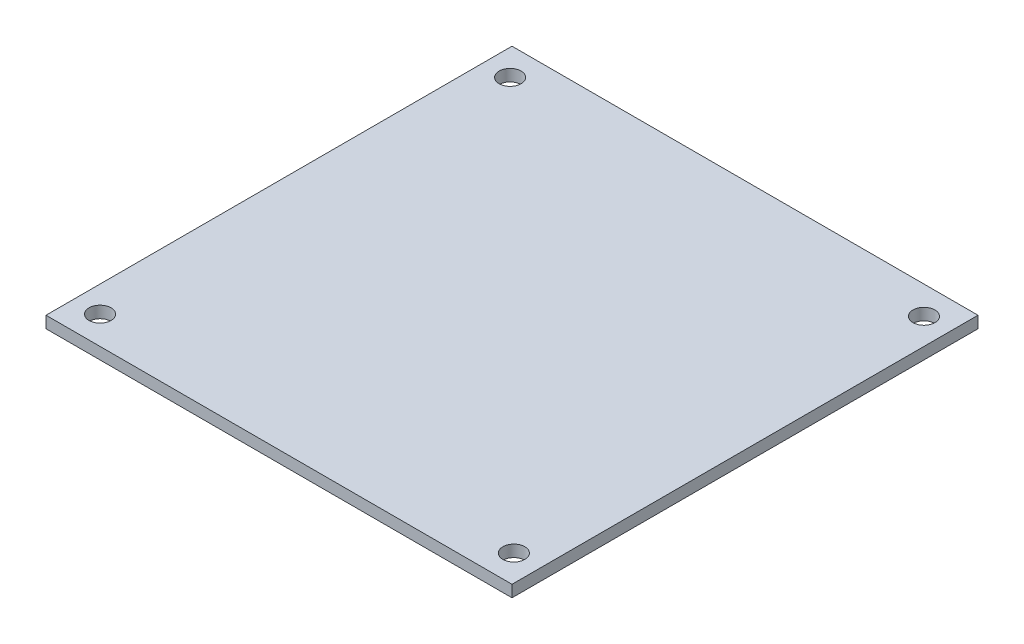
ISO-10303-21;
HEADER;
FILE_DESCRIPTION(('STEP AP214'),'2;1');
FILE_NAME('part.step','',(''),(''),'','','');
FILE_SCHEMA(('AUTOMOTIVE_DESIGN { 1 0 10303 214 1 1 1 1 }'));
ENDSEC;
DATA;
#1=APPLICATION_CONTEXT('core data for automotive mechanical design processes');
#2=APPLICATION_PROTOCOL_DEFINITION('international standard','automotive_design',2000,#1);
#3=PRODUCT_CONTEXT('',#1,'mechanical');
#4=PRODUCT('Part','Part','',(#3));
#5=PRODUCT_RELATED_PRODUCT_CATEGORY('part','',(#4));
#6=PRODUCT_DEFINITION_FORMATION('','',#4);
#7=PRODUCT_DEFINITION_CONTEXT('part definition',#1,'design');
#8=PRODUCT_DEFINITION('design','',#6,#7);
#9=PRODUCT_DEFINITION_SHAPE('','',#8);
#10=(LENGTH_UNIT() NAMED_UNIT(*) SI_UNIT(.MILLI.,.METRE.));
#11=(NAMED_UNIT(*) PLANE_ANGLE_UNIT() SI_UNIT($,.RADIAN.));
#12=(NAMED_UNIT(*) SI_UNIT($,.STERADIAN.) SOLID_ANGLE_UNIT());
#13=UNCERTAINTY_MEASURE_WITH_UNIT(LENGTH_MEASURE(1.E-05),#10,'distance_accuracy_value','');
#14=(GEOMETRIC_REPRESENTATION_CONTEXT(3) GLOBAL_UNCERTAINTY_ASSIGNED_CONTEXT((#13)) GLOBAL_UNIT_ASSIGNED_CONTEXT((#10,
#11,#12)) REPRESENTATION_CONTEXT('',''));
#15=CARTESIAN_POINT('',(0.,0.,0.));
#16=DIRECTION('',(0.,0.,1.));
#17=DIRECTION('',(1.,0.,0.));
#18=AXIS2_PLACEMENT_3D('',#15,#16,#17);
#19=CARTESIAN_POINT('',(0.,1.6,0.));
#20=DIRECTION('',(0.,1.,0.));
#21=DIRECTION('',(0.,0.,1.));
#22=AXIS2_PLACEMENT_3D('',#19,#20,#21);
#23=PLANE('',#22);
#24=CARTESIAN_POINT('',(28.194,1.6,27.94));
#25=DIRECTION('',(0.,1.,0.));
#26=DIRECTION('',(0.,0.,-1.));
#27=AXIS2_PLACEMENT_3D('',#24,#25,#26);
#28=CIRCLE('',#27,1.5);
#29=CARTESIAN_POINT('',(28.194,1.6,26.44));
#30=VERTEX_POINT('',#29);
#31=EDGE_CURVE('E122',#30,#30,#28,.T.);
#32=ORIENTED_EDGE('',*,*,#31,.F.);
#33=EDGE_LOOP('',(#32));
#34=FACE_BOUND('',#33,.T.);
#35=CARTESIAN_POINT('',(-28.194,1.6,-27.94));
#36=DIRECTION('',(0.,1.,0.));
#37=DIRECTION('',(0.,0.,1.));
#38=AXIS2_PLACEMENT_3D('',#35,#36,#37);
#39=CIRCLE('',#38,1.5);
#40=CARTESIAN_POINT('',(-28.194,1.6,-26.44));
#41=VERTEX_POINT('',#40);
#42=EDGE_CURVE('E101',#41,#41,#39,.T.);
#43=ORIENTED_EDGE('',*,*,#42,.F.);
#44=EDGE_LOOP('',(#43));
#45=FACE_BOUND('',#44,.T.);
#46=DIRECTION('',(0.,0.,1.));
#47=VECTOR('',#46,1.);
#48=CARTESIAN_POINT('',(-31.75,1.6,31.75));
#49=LINE('',#48,#47);
#50=CARTESIAN_POINT('',(-31.75,1.6,-31.75));
#51=VERTEX_POINT('',#50);
#52=CARTESIAN_POINT('',(-31.75,1.6,31.75));
#53=VERTEX_POINT('',#52);
#54=EDGE_CURVE('E86',#51,#53,#49,.T.);
#55=ORIENTED_EDGE('',*,*,#54,.T.);
#56=DIRECTION('',(1.,0.,0.));
#57=VECTOR('',#56,1.);
#58=CARTESIAN_POINT('',(31.75,1.6,31.75));
#59=LINE('',#58,#57);
#60=CARTESIAN_POINT('',(31.75,1.6,31.75));
#61=VERTEX_POINT('',#60);
#62=EDGE_CURVE('E81',#53,#61,#59,.T.);
#63=ORIENTED_EDGE('',*,*,#62,.T.);
#64=DIRECTION('',(0.,0.,-1.));
#65=VECTOR('',#64,1.);
#66=CARTESIAN_POINT('',(31.75,1.6,31.75));
#67=LINE('',#66,#65);
#68=CARTESIAN_POINT('',(31.75,1.6,-31.75));
#69=VERTEX_POINT('',#68);
#70=EDGE_CURVE('E84',#61,#69,#67,.T.);
#71=ORIENTED_EDGE('',*,*,#70,.T.);
#72=DIRECTION('',(-1.,0.,0.));
#73=VECTOR('',#72,1.);
#74=CARTESIAN_POINT('',(31.75,1.6,-31.75));
#75=LINE('',#74,#73);
#76=EDGE_CURVE('E51',#69,#51,#75,.T.);
#77=ORIENTED_EDGE('',*,*,#76,.T.);
#78=EDGE_LOOP('',(#55,#63,#71,#77));
#79=FACE_BOUND('',#78,.T.);
#80=CARTESIAN_POINT('',(28.194,1.6,-27.94));
#81=DIRECTION('',(0.,1.,0.));
#82=DIRECTION('',(0.,0.,1.));
#83=AXIS2_PLACEMENT_3D('',#80,#81,#82);
#84=CIRCLE('',#83,1.5);
#85=CARTESIAN_POINT('',(28.194,1.6,-26.44));
#86=VERTEX_POINT('',#85);
#87=EDGE_CURVE('E116',#86,#86,#84,.T.);
#88=ORIENTED_EDGE('',*,*,#87,.F.);
#89=EDGE_LOOP('',(#88));
#90=FACE_BOUND('',#89,.T.);
#91=CARTESIAN_POINT('',(-28.194,1.6,27.94));
#92=DIRECTION('',(0.,1.,0.));
#93=DIRECTION('',(0.,0.,-1.));
#94=AXIS2_PLACEMENT_3D('',#91,#92,#93);
#95=CIRCLE('',#94,1.5);
#96=CARTESIAN_POINT('',(-28.194,1.6,26.44));
#97=VERTEX_POINT('',#96);
#98=EDGE_CURVE('E128',#97,#97,#95,.T.);
#99=ORIENTED_EDGE('',*,*,#98,.F.);
#100=EDGE_LOOP('',(#99));
#101=FACE_BOUND('',#100,.T.);
#102=ADVANCED_FACE('F34',(#34,#45,#79,#90,#101),#23,.T.);
#103=CARTESIAN_POINT('',(0.,0.,0.));
#104=DIRECTION('',(0.,1.,0.));
#105=DIRECTION('',(0.,0.,1.));
#106=AXIS2_PLACEMENT_3D('',#103,#104,#105);
#107=PLANE('',#106);
#108=DIRECTION('',(0.,0.,1.));
#109=VECTOR('',#108,1.);
#110=CARTESIAN_POINT('',(-31.75,0.,31.75));
#111=LINE('',#110,#109);
#112=CARTESIAN_POINT('',(-31.75,0.,-31.75));
#113=VERTEX_POINT('',#112);
#114=CARTESIAN_POINT('',(-31.75,0.,31.75));
#115=VERTEX_POINT('',#114);
#116=EDGE_CURVE('E98',#113,#115,#111,.T.);
#117=ORIENTED_EDGE('',*,*,#116,.F.);
#118=DIRECTION('',(-1.,0.,0.));
#119=VECTOR('',#118,1.);
#120=CARTESIAN_POINT('',(31.75,0.,-31.75));
#121=LINE('',#120,#119);
#122=CARTESIAN_POINT('',(31.75,0.,-31.75));
#123=VERTEX_POINT('',#122);
#124=EDGE_CURVE('E74',#123,#113,#121,.T.);
#125=ORIENTED_EDGE('',*,*,#124,.F.);
#126=DIRECTION('',(0.,0.,-1.));
#127=VECTOR('',#126,1.);
#128=CARTESIAN_POINT('',(31.75,0.,31.75));
#129=LINE('',#128,#127);
#130=CARTESIAN_POINT('',(31.75,0.,31.75));
#131=VERTEX_POINT('',#130);
#132=EDGE_CURVE('E68',#131,#123,#129,.T.);
#133=ORIENTED_EDGE('',*,*,#132,.F.);
#134=DIRECTION('',(1.,0.,0.));
#135=VECTOR('',#134,1.);
#136=CARTESIAN_POINT('',(31.75,0.,31.75));
#137=LINE('',#136,#135);
#138=EDGE_CURVE('E90',#115,#131,#137,.T.);
#139=ORIENTED_EDGE('',*,*,#138,.F.);
#140=EDGE_LOOP('',(#117,#125,#133,#139));
#141=FACE_BOUND('',#140,.T.);
#142=CARTESIAN_POINT('',(-28.194,0.,-27.94));
#143=DIRECTION('',(0.,1.,0.));
#144=DIRECTION('',(0.,0.,1.));
#145=AXIS2_PLACEMENT_3D('',#142,#143,#144);
#146=CIRCLE('',#145,1.5);
#147=CARTESIAN_POINT('',(-28.194,0.,-26.44));
#148=VERTEX_POINT('',#147);
#149=EDGE_CURVE('E113',#148,#148,#146,.T.);
#150=ORIENTED_EDGE('',*,*,#149,.T.);
#151=EDGE_LOOP('',(#150));
#152=FACE_BOUND('',#151,.T.);
#153=CARTESIAN_POINT('',(28.194,0.,-27.94));
#154=DIRECTION('',(0.,1.,0.));
#155=DIRECTION('',(0.,0.,1.));
#156=AXIS2_PLACEMENT_3D('',#153,#154,#155);
#157=CIRCLE('',#156,1.5);
#158=CARTESIAN_POINT('',(28.194,0.,-26.44));
#159=VERTEX_POINT('',#158);
#160=EDGE_CURVE('E119',#159,#159,#157,.T.);
#161=ORIENTED_EDGE('',*,*,#160,.T.);
#162=EDGE_LOOP('',(#161));
#163=FACE_BOUND('',#162,.T.);
#164=CARTESIAN_POINT('',(28.194,0.,27.94));
#165=DIRECTION('',(0.,1.,0.));
#166=DIRECTION('',(0.,0.,-1.));
#167=AXIS2_PLACEMENT_3D('',#164,#165,#166);
#168=CIRCLE('',#167,1.5);
#169=CARTESIAN_POINT('',(28.194,0.,26.44));
#170=VERTEX_POINT('',#169);
#171=EDGE_CURVE('E125',#170,#170,#168,.T.);
#172=ORIENTED_EDGE('',*,*,#171,.T.);
#173=EDGE_LOOP('',(#172));
#174=FACE_BOUND('',#173,.T.);
#175=CARTESIAN_POINT('',(-28.194,0.,27.94));
#176=DIRECTION('',(0.,1.,0.));
#177=DIRECTION('',(0.,0.,-1.));
#178=AXIS2_PLACEMENT_3D('',#175,#176,#177);
#179=CIRCLE('',#178,1.5);
#180=CARTESIAN_POINT('',(-28.194,0.,26.44));
#181=VERTEX_POINT('',#180);
#182=EDGE_CURVE('E131',#181,#181,#179,.T.);
#183=ORIENTED_EDGE('',*,*,#182,.T.);
#184=EDGE_LOOP('',(#183));
#185=FACE_BOUND('',#184,.T.);
#186=ADVANCED_FACE('F109',(#141,#152,#163,#174,#185),#107,.F.);
#187=CARTESIAN_POINT('',(-31.75,1.6,31.75));
#188=DIRECTION('',(1.,0.,0.));
#189=DIRECTION('',(0.,0.,-1.));
#190=AXIS2_PLACEMENT_3D('',#187,#188,#189);
#191=PLANE('',#190);
#192=ORIENTED_EDGE('',*,*,#116,.T.);
#193=DIRECTION('',(0.,-1.,0.));
#194=VECTOR('',#193,1.);
#195=CARTESIAN_POINT('',(-31.75,1.6,31.75));
#196=LINE('',#195,#194);
#197=EDGE_CURVE('E11',#53,#115,#196,.T.);
#198=ORIENTED_EDGE('',*,*,#197,.F.);
#199=ORIENTED_EDGE('',*,*,#54,.F.);
#200=DIRECTION('',(0.,-1.,0.));
#201=VECTOR('',#200,1.);
#202=CARTESIAN_POINT('',(-31.75,1.6,-31.75));
#203=LINE('',#202,#201);
#204=EDGE_CURVE('E94',#51,#113,#203,.T.);
#205=ORIENTED_EDGE('',*,*,#204,.T.);
#206=EDGE_LOOP('',(#192,#198,#199,#205));
#207=FACE_BOUND('',#206,.T.);
#208=ADVANCED_FACE('F36',(#207),#191,.F.);
#209=CARTESIAN_POINT('',(31.75,1.6,31.75));
#210=DIRECTION('',(0.,0.,-1.));
#211=DIRECTION('',(-1.,0.,0.));
#212=AXIS2_PLACEMENT_3D('',#209,#210,#211);
#213=PLANE('',#212);
#214=ORIENTED_EDGE('',*,*,#138,.T.);
#215=DIRECTION('',(0.,-1.,0.));
#216=VECTOR('',#215,1.);
#217=CARTESIAN_POINT('',(31.75,1.6,31.75));
#218=LINE('',#217,#216);
#219=EDGE_CURVE('E43',#61,#131,#218,.T.);
#220=ORIENTED_EDGE('',*,*,#219,.F.);
#221=ORIENTED_EDGE('',*,*,#62,.F.);
#222=ORIENTED_EDGE('',*,*,#197,.T.);
#223=EDGE_LOOP('',(#214,#220,#221,#222));
#224=FACE_BOUND('',#223,.T.);
#225=ADVANCED_FACE('F89',(#224),#213,.F.);
#226=CARTESIAN_POINT('',(31.75,1.6,31.75));
#227=DIRECTION('',(-1.,0.,0.));
#228=DIRECTION('',(0.,0.,1.));
#229=AXIS2_PLACEMENT_3D('',#226,#227,#228);
#230=PLANE('',#229);
#231=ORIENTED_EDGE('',*,*,#132,.T.);
#232=DIRECTION('',(0.,-1.,0.));
#233=VECTOR('',#232,1.);
#234=CARTESIAN_POINT('',(31.75,1.6,-31.75));
#235=LINE('',#234,#233);
#236=EDGE_CURVE('E91',#69,#123,#235,.T.);
#237=ORIENTED_EDGE('',*,*,#236,.F.);
#238=ORIENTED_EDGE('',*,*,#70,.F.);
#239=ORIENTED_EDGE('',*,*,#219,.T.);
#240=EDGE_LOOP('',(#231,#237,#238,#239));
#241=FACE_BOUND('',#240,.T.);
#242=ADVANCED_FACE('F92',(#241),#230,.F.);
#243=CARTESIAN_POINT('',(31.75,1.6,-31.75));
#244=DIRECTION('',(0.,0.,1.));
#245=DIRECTION('',(1.,0.,0.));
#246=AXIS2_PLACEMENT_3D('',#243,#244,#245);
#247=PLANE('',#246);
#248=ORIENTED_EDGE('',*,*,#124,.T.);
#249=ORIENTED_EDGE('',*,*,#204,.F.);
#250=ORIENTED_EDGE('',*,*,#76,.F.);
#251=ORIENTED_EDGE('',*,*,#236,.T.);
#252=EDGE_LOOP('',(#248,#249,#250,#251));
#253=FACE_BOUND('',#252,.T.);
#254=ADVANCED_FACE('F106',(#253),#247,.F.);
#255=CARTESIAN_POINT('',(-28.194,1.6,-27.94));
#256=DIRECTION('',(0.,-1.,0.));
#257=DIRECTION('',(0.,0.,-1.));
#258=AXIS2_PLACEMENT_3D('',#255,#256,#257);
#259=CYLINDRICAL_SURFACE('',#258,1.5);
#260=ORIENTED_EDGE('',*,*,#42,.T.);
#261=EDGE_LOOP('',(#260));
#262=FACE_BOUND('',#261,.T.);
#263=ORIENTED_EDGE('',*,*,#149,.F.);
#264=EDGE_LOOP('',(#263));
#265=FACE_BOUND('',#264,.T.);
#266=ADVANCED_FACE('F150',(#262,#265),#259,.F.);
#267=CARTESIAN_POINT('',(28.194,1.6,-27.94));
#268=DIRECTION('',(0.,-1.,0.));
#269=DIRECTION('',(0.,0.,-1.));
#270=AXIS2_PLACEMENT_3D('',#267,#268,#269);
#271=CYLINDRICAL_SURFACE('',#270,1.5);
#272=ORIENTED_EDGE('',*,*,#87,.T.);
#273=EDGE_LOOP('',(#272));
#274=FACE_BOUND('',#273,.T.);
#275=ORIENTED_EDGE('',*,*,#160,.F.);
#276=EDGE_LOOP('',(#275));
#277=FACE_BOUND('',#276,.T.);
#278=ADVANCED_FACE('F196',(#274,#277),#271,.F.);
#279=CARTESIAN_POINT('',(28.194,1.6,27.94));
#280=DIRECTION('',(0.,-1.,0.));
#281=DIRECTION('',(0.,0.,-1.));
#282=AXIS2_PLACEMENT_3D('',#279,#280,#281);
#283=CYLINDRICAL_SURFACE('',#282,1.5);
#284=ORIENTED_EDGE('',*,*,#31,.T.);
#285=EDGE_LOOP('',(#284));
#286=FACE_BOUND('',#285,.T.);
#287=ORIENTED_EDGE('',*,*,#171,.F.);
#288=EDGE_LOOP('',(#287));
#289=FACE_BOUND('',#288,.T.);
#290=ADVANCED_FACE('F204',(#286,#289),#283,.F.);
#291=CARTESIAN_POINT('',(-28.194,1.6,27.94));
#292=DIRECTION('',(0.,-1.,0.));
#293=DIRECTION('',(0.,0.,-1.));
#294=AXIS2_PLACEMENT_3D('',#291,#292,#293);
#295=CYLINDRICAL_SURFACE('',#294,1.5);
#296=ORIENTED_EDGE('',*,*,#98,.T.);
#297=EDGE_LOOP('',(#296));
#298=FACE_BOUND('',#297,.T.);
#299=ORIENTED_EDGE('',*,*,#182,.F.);
#300=EDGE_LOOP('',(#299));
#301=FACE_BOUND('',#300,.T.);
#302=ADVANCED_FACE('F137',(#298,#301),#295,.F.);
#303=CLOSED_SHELL('',(#102,#186,#208,#225,#242,#254,#266,#278,#290,#302));
#304=MANIFOLD_SOLID_BREP('B2',#303);
#305=ADVANCED_BREP_SHAPE_REPRESENTATION('',(#18,#304),#14);
#306=SHAPE_DEFINITION_REPRESENTATION(#9,#305);
ENDSEC;
END-ISO-10303-21;
